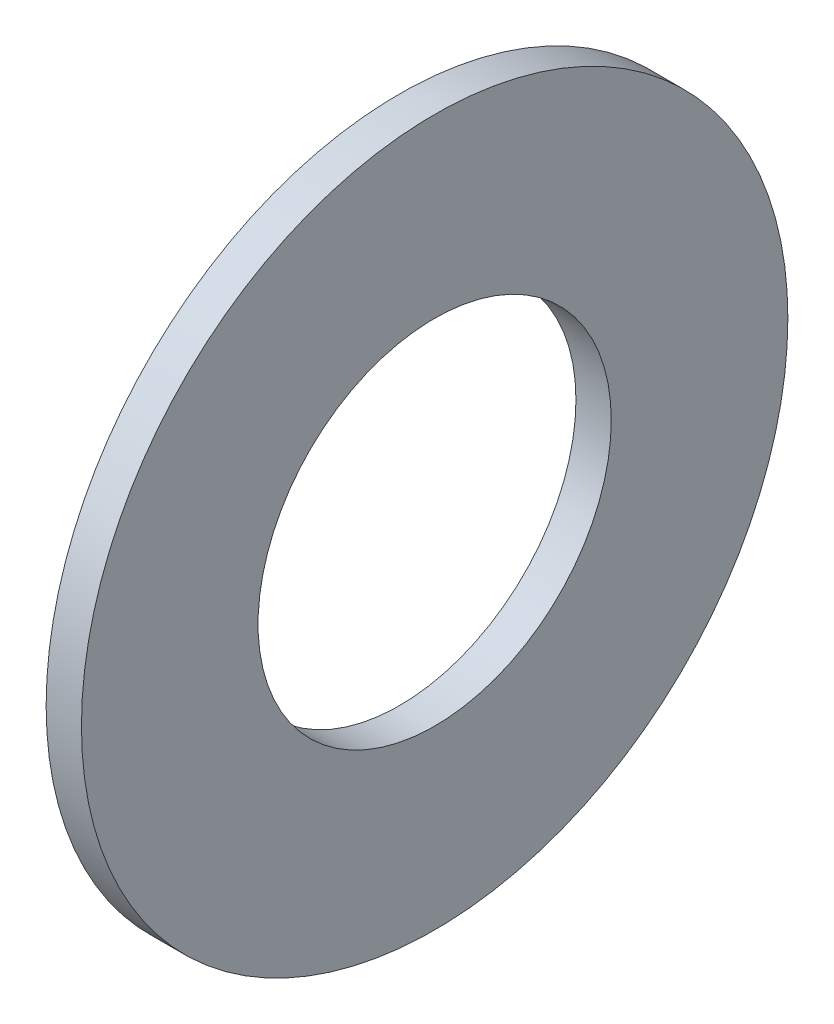
ISO-10303-21;
HEADER;
FILE_DESCRIPTION(('STEP AP214'),'2;1');
FILE_NAME('part.step','',(''),(''),'','','');
FILE_SCHEMA(('AUTOMOTIVE_DESIGN { 1 0 10303 214 1 1 1 1 }'));
ENDSEC;
DATA;
#1=APPLICATION_CONTEXT('core data for automotive mechanical design processes');
#2=APPLICATION_PROTOCOL_DEFINITION('international standard','automotive_design',2000,#1);
#3=PRODUCT_CONTEXT('',#1,'mechanical');
#4=PRODUCT('Part','Part','',(#3));
#5=PRODUCT_RELATED_PRODUCT_CATEGORY('part','',(#4));
#6=PRODUCT_DEFINITION_FORMATION('','',#4);
#7=PRODUCT_DEFINITION_CONTEXT('part definition',#1,'design');
#8=PRODUCT_DEFINITION('design','',#6,#7);
#9=PRODUCT_DEFINITION_SHAPE('','',#8);
#10=(LENGTH_UNIT() NAMED_UNIT(*) SI_UNIT(.MILLI.,.METRE.));
#11=(NAMED_UNIT(*) PLANE_ANGLE_UNIT() SI_UNIT($,.RADIAN.));
#12=(NAMED_UNIT(*) SI_UNIT($,.STERADIAN.) SOLID_ANGLE_UNIT());
#13=UNCERTAINTY_MEASURE_WITH_UNIT(LENGTH_MEASURE(1.E-05),#10,'distance_accuracy_value','');
#14=(GEOMETRIC_REPRESENTATION_CONTEXT(3) GLOBAL_UNCERTAINTY_ASSIGNED_CONTEXT((#13)) GLOBAL_UNIT_ASSIGNED_CONTEXT((#10,
#11,#12)) REPRESENTATION_CONTEXT('',''));
#15=CARTESIAN_POINT('',(0.,0.,0.));
#16=DIRECTION('',(0.,0.,1.));
#17=DIRECTION('',(1.,0.,0.));
#18=AXIS2_PLACEMENT_3D('',#15,#16,#17);
#19=CARTESIAN_POINT('',(2.,0.,0.));
#20=DIRECTION('',(1.,0.,0.));
#21=DIRECTION('',(0.,0.,-1.));
#22=AXIS2_PLACEMENT_3D('',#19,#20,#21);
#23=PLANE('',#22);
#24=CARTESIAN_POINT('',(2.,0.,0.));
#25=DIRECTION('',(1.,0.,0.));
#26=DIRECTION('',(0.,0.,-1.));
#27=AXIS2_PLACEMENT_3D('',#24,#25,#26);
#28=CIRCLE('',#27,20.);
#29=CARTESIAN_POINT('',(2.,0.,-20.));
#30=VERTEX_POINT('',#29);
#31=EDGE_CURVE('E10',#30,#30,#28,.T.);
#32=ORIENTED_EDGE('',*,*,#31,.T.);
#33=EDGE_LOOP('',(#32));
#34=FACE_BOUND('',#33,.T.);
#35=CARTESIAN_POINT('',(2.,0.,0.));
#36=DIRECTION('',(1.,0.,0.));
#37=DIRECTION('',(0.,0.,-1.));
#38=AXIS2_PLACEMENT_3D('',#35,#36,#37);
#39=CIRCLE('',#38,10.);
#40=CARTESIAN_POINT('',(2.,0.,-10.));
#41=VERTEX_POINT('',#40);
#42=EDGE_CURVE('E54',#41,#41,#39,.T.);
#43=ORIENTED_EDGE('',*,*,#42,.F.);
#44=EDGE_LOOP('',(#43));
#45=FACE_BOUND('',#44,.T.);
#46=ADVANCED_FACE('F41',(#34,#45),#23,.T.);
#47=CARTESIAN_POINT('',(0.,0.,0.));
#48=DIRECTION('',(1.,0.,0.));
#49=DIRECTION('',(0.,0.,-1.));
#50=AXIS2_PLACEMENT_3D('',#47,#48,#49);
#51=PLANE('',#50);
#52=CARTESIAN_POINT('',(0.,0.,0.));
#53=DIRECTION('',(1.,0.,0.));
#54=DIRECTION('',(0.,0.,-1.));
#55=AXIS2_PLACEMENT_3D('',#52,#53,#54);
#56=CIRCLE('',#55,20.);
#57=CARTESIAN_POINT('',(0.,0.,-20.));
#58=VERTEX_POINT('',#57);
#59=EDGE_CURVE('E45',#58,#58,#56,.T.);
#60=ORIENTED_EDGE('',*,*,#59,.F.);
#61=EDGE_LOOP('',(#60));
#62=FACE_BOUND('',#61,.T.);
#63=CARTESIAN_POINT('',(0.,0.,0.));
#64=DIRECTION('',(1.,0.,0.));
#65=DIRECTION('',(0.,0.,-1.));
#66=AXIS2_PLACEMENT_3D('',#63,#64,#65);
#67=CIRCLE('',#66,10.);
#68=CARTESIAN_POINT('',(0.,0.,-10.));
#69=VERTEX_POINT('',#68);
#70=EDGE_CURVE('E56',#69,#69,#67,.T.);
#71=ORIENTED_EDGE('',*,*,#70,.T.);
#72=EDGE_LOOP('',(#71));
#73=FACE_BOUND('',#72,.T.);
#74=ADVANCED_FACE('F68',(#62,#73),#51,.F.);
#75=CARTESIAN_POINT('',(2.,0.,0.));
#76=DIRECTION('',(-1.,0.,0.));
#77=DIRECTION('',(0.,0.,1.));
#78=AXIS2_PLACEMENT_3D('',#75,#76,#77);
#79=CYLINDRICAL_SURFACE('',#78,20.);
#80=ORIENTED_EDGE('',*,*,#31,.F.);
#81=EDGE_LOOP('',(#80));
#82=FACE_BOUND('',#81,.T.);
#83=ORIENTED_EDGE('',*,*,#59,.T.);
#84=EDGE_LOOP('',(#83));
#85=FACE_BOUND('',#84,.T.);
#86=ADVANCED_FACE('F43',(#82,#85),#79,.T.);
#87=CARTESIAN_POINT('',(2.,0.,0.));
#88=DIRECTION('',(-1.,0.,0.));
#89=DIRECTION('',(0.,0.,1.));
#90=AXIS2_PLACEMENT_3D('',#87,#88,#89);
#91=CYLINDRICAL_SURFACE('',#90,10.);
#92=ORIENTED_EDGE('',*,*,#42,.T.);
#93=EDGE_LOOP('',(#92));
#94=FACE_BOUND('',#93,.T.);
#95=ORIENTED_EDGE('',*,*,#70,.F.);
#96=EDGE_LOOP('',(#95));
#97=FACE_BOUND('',#96,.T.);
#98=ADVANCED_FACE('F64',(#94,#97),#91,.F.);
#99=CLOSED_SHELL('',(#46,#74,#86,#98));
#100=MANIFOLD_SOLID_BREP('B2',#99);
#101=ADVANCED_BREP_SHAPE_REPRESENTATION('',(#18,#100),#14);
#102=SHAPE_DEFINITION_REPRESENTATION(#9,#101);
ENDSEC;
END-ISO-10303-21;
